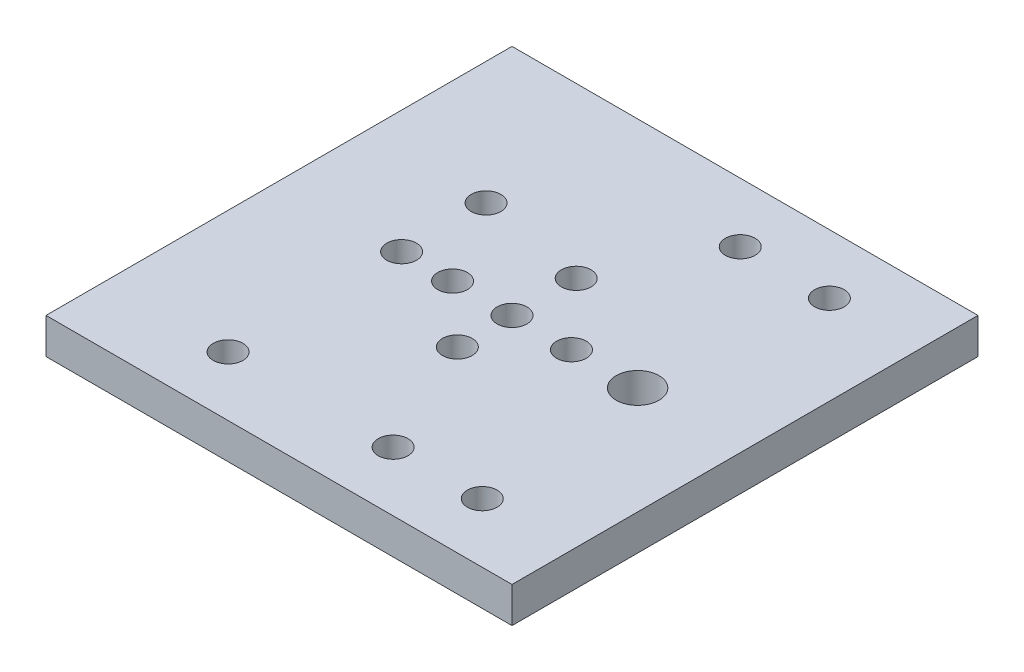
ISO-10303-21;
HEADER;
FILE_DESCRIPTION(('STEP AP214'),'2;1');
FILE_NAME('part.step','',(''),(''),'','','');
FILE_SCHEMA(('AUTOMOTIVE_DESIGN { 1 0 10303 214 1 1 1 1 }'));
ENDSEC;
DATA;
#1=APPLICATION_CONTEXT('core data for automotive mechanical design processes');
#2=APPLICATION_PROTOCOL_DEFINITION('international standard','automotive_design',2000,#1);
#3=PRODUCT_CONTEXT('',#1,'mechanical');
#4=PRODUCT('Part','Part','',(#3));
#5=PRODUCT_RELATED_PRODUCT_CATEGORY('part','',(#4));
#6=PRODUCT_DEFINITION_FORMATION('','',#4);
#7=PRODUCT_DEFINITION_CONTEXT('part definition',#1,'design');
#8=PRODUCT_DEFINITION('design','',#6,#7);
#9=PRODUCT_DEFINITION_SHAPE('','',#8);
#10=(LENGTH_UNIT() NAMED_UNIT(*) SI_UNIT(.MILLI.,.METRE.));
#11=(NAMED_UNIT(*) PLANE_ANGLE_UNIT() SI_UNIT($,.RADIAN.));
#12=(NAMED_UNIT(*) SI_UNIT($,.STERADIAN.) SOLID_ANGLE_UNIT());
#13=UNCERTAINTY_MEASURE_WITH_UNIT(LENGTH_MEASURE(1.E-05),#10,'distance_accuracy_value','');
#14=(GEOMETRIC_REPRESENTATION_CONTEXT(3) GLOBAL_UNCERTAINTY_ASSIGNED_CONTEXT((#13)) GLOBAL_UNIT_ASSIGNED_CONTEXT((#10,
#11,#12)) REPRESENTATION_CONTEXT('',''));
#15=CARTESIAN_POINT('',(0.,0.,0.));
#16=DIRECTION('',(0.,0.,1.));
#17=DIRECTION('',(1.,0.,0.));
#18=AXIS2_PLACEMENT_3D('',#15,#16,#17);
#19=CARTESIAN_POINT('',(0.,6.,0.));
#20=DIRECTION('',(0.,1.,0.));
#21=DIRECTION('',(0.,0.,1.));
#22=AXIS2_PLACEMENT_3D('',#19,#20,#21);
#23=PLANE('',#22);
#24=CARTESIAN_POINT('',(64.574651673796,6.,38.9945207187271));
#25=DIRECTION('',(0.,1.,0.));
#26=DIRECTION('',(0.,0.,1.));
#27=AXIS2_PLACEMENT_3D('',#24,#25,#26);
#28=CIRCLE('',#27,2.5);
#29=CARTESIAN_POINT('',(64.574651673796,6.,41.4945207187271));
#30=VERTEX_POINT('',#29);
#31=EDGE_CURVE('E174',#30,#30,#28,.T.);
#32=ORIENTED_EDGE('',*,*,#31,.F.);
#33=EDGE_LOOP('',(#32));
#34=FACE_BOUND('',#33,.T.);
#35=CARTESIAN_POINT('',(40.375415282392,6.,18.9945207187271));
#36=DIRECTION('',(0.,1.,0.));
#37=DIRECTION('',(0.,0.,1.));
#38=AXIS2_PLACEMENT_3D('',#35,#36,#37);
#39=CIRCLE('',#38,2.5);
#40=CARTESIAN_POINT('',(40.375415282392,6.,21.4945207187271));
#41=VERTEX_POINT('',#40);
#42=EDGE_CURVE('E162',#41,#41,#39,.T.);
#43=ORIENTED_EDGE('',*,*,#42,.F.);
#44=EDGE_LOOP('',(#43));
#45=FACE_BOUND('',#44,.T.);
#46=CARTESIAN_POINT('',(64.574651673796,6.,-19.4039520640808));
#47=DIRECTION('',(0.,1.,0.));
#48=DIRECTION('',(0.,0.,1.));
#49=AXIS2_PLACEMENT_3D('',#46,#47,#48);
#50=CIRCLE('',#49,2.49999999999999);
#51=CARTESIAN_POINT('',(64.574651673796,6.,-16.9039520640808));
#52=VERTEX_POINT('',#51);
#53=EDGE_CURVE('E150',#52,#52,#50,.T.);
#54=ORIENTED_EDGE('',*,*,#53,.F.);
#55=EDGE_LOOP('',(#54));
#56=FACE_BOUND('',#55,.T.);
#57=CARTESIAN_POINT('',(21.8066370561457,6.,9.79528432732314));
#58=DIRECTION('',(0.,1.,0.));
#59=DIRECTION('',(0.,0.,1.));
#60=AXIS2_PLACEMENT_3D('',#57,#58,#59);
#61=CIRCLE('',#60,2.5);
#62=CARTESIAN_POINT('',(21.8066370561457,6.,12.2952843273231));
#63=VERTEX_POINT('',#62);
#64=EDGE_CURVE('E138',#63,#63,#61,.T.);
#65=ORIENTED_EDGE('',*,*,#64,.F.);
#66=EDGE_LOOP('',(#65));
#67=FACE_BOUND('',#66,.T.);
#68=CARTESIAN_POINT('',(40.375415282392,6.,9.79528432732314));
#69=DIRECTION('',(0.,1.,0.));
#70=DIRECTION('',(0.,0.,1.));
#71=AXIS2_PLACEMENT_3D('',#68,#69,#70);
#72=CIRCLE('',#71,2.5);
#73=CARTESIAN_POINT('',(40.375415282392,6.,12.2952843273231));
#74=VERTEX_POINT('',#73);
#75=EDGE_CURVE('E126',#74,#74,#72,.T.);
#76=ORIENTED_EDGE('',*,*,#75,.F.);
#77=EDGE_LOOP('',(#76));
#78=FACE_BOUND('',#77,.T.);
#79=CARTESIAN_POINT('',(21.8066370561457,6.,38.9945207187271));
#80=DIRECTION('',(0.,1.,0.));
#81=DIRECTION('',(0.,0.,1.));
#82=AXIS2_PLACEMENT_3D('',#79,#80,#81);
#83=CIRCLE('',#82,2.5);
#84=CARTESIAN_POINT('',(21.8066370561457,6.,41.4945207187271));
#85=VERTEX_POINT('',#84);
#86=EDGE_CURVE('E114',#85,#85,#83,.T.);
#87=ORIENTED_EDGE('',*,*,#86,.F.);
#88=EDGE_LOOP('',(#87));
#89=FACE_BOUND('',#88,.T.);
#90=DIRECTION('',(1.,0.,0.));
#91=VECTOR('',#90,1.);
#92=CARTESIAN_POINT('',(1.17617889098803,6.,48.9945207187271));
#93=LINE('',#92,#91);
#94=CARTESIAN_POINT('',(1.17617889098803,6.,48.9945207187271));
#95=VERTEX_POINT('',#94);
#96=CARTESIAN_POINT('',(79.574651673796,6.,48.9945207187271));
#97=VERTEX_POINT('',#96);
#98=EDGE_CURVE('E84',#95,#97,#93,.T.);
#99=ORIENTED_EDGE('',*,*,#98,.T.);
#100=DIRECTION('',(0.,0.,-1.));
#101=VECTOR('',#100,1.);
#102=CARTESIAN_POINT('',(79.574651673796,6.,48.9945207187271));
#103=LINE('',#102,#101);
#104=CARTESIAN_POINT('',(79.574651673796,6.,-29.4039520640808));
#105=VERTEX_POINT('',#104);
#106=EDGE_CURVE('E79',#97,#105,#103,.T.);
#107=ORIENTED_EDGE('',*,*,#106,.T.);
#108=DIRECTION('',(-1.,0.,0.));
#109=VECTOR('',#108,1.);
#110=CARTESIAN_POINT('',(1.17617889098802,6.,-29.4039520640808));
#111=LINE('',#110,#109);
#112=CARTESIAN_POINT('',(1.17617889098802,6.,-29.4039520640808));
#113=VERTEX_POINT('',#112);
#114=EDGE_CURVE('E82',#105,#113,#111,.T.);
#115=ORIENTED_EDGE('',*,*,#114,.T.);
#116=DIRECTION('',(0.,0.,1.));
#117=VECTOR('',#116,1.);
#118=CARTESIAN_POINT('',(1.17617889098802,6.,-29.4039520640808));
#119=LINE('',#118,#117);
#120=EDGE_CURVE('E49',#113,#95,#119,.T.);
#121=ORIENTED_EDGE('',*,*,#120,.T.);
#122=EDGE_LOOP('',(#99,#107,#115,#121));
#123=FACE_BOUND('',#122,.T.);
#124=CARTESIAN_POINT('',(21.8066370561457,6.,-4.40395206408081));
#125=DIRECTION('',(0.,1.,0.));
#126=DIRECTION('',(0.,0.,1.));
#127=AXIS2_PLACEMENT_3D('',#124,#125,#126);
#128=CIRCLE('',#127,2.5);
#129=CARTESIAN_POINT('',(21.8066370561457,6.,-1.90395206408081));
#130=VERTEX_POINT('',#129);
#131=EDGE_CURVE('E99',#130,#130,#128,.T.);
#132=ORIENTED_EDGE('',*,*,#131,.F.);
#133=EDGE_LOOP('',(#132));
#134=FACE_BOUND('',#133,.T.);
#135=CARTESIAN_POINT('',(61.5066370561457,6.,9.79528432732314));
#136=DIRECTION('',(0.,1.,0.));
#137=DIRECTION('',(0.,0.,1.));
#138=AXIS2_PLACEMENT_3D('',#135,#136,#137);
#139=CIRCLE('',#138,3.59999999999999);
#140=CARTESIAN_POINT('',(61.5066370561457,6.,13.3952843273231));
#141=VERTEX_POINT('',#140);
#142=EDGE_CURVE('E120',#141,#141,#139,.T.);
#143=ORIENTED_EDGE('',*,*,#142,.F.);
#144=EDGE_LOOP('',(#143));
#145=FACE_BOUND('',#144,.T.);
#146=CARTESIAN_POINT('',(30.375415282392,6.,9.79528432732314));
#147=DIRECTION('',(0.,1.,0.));
#148=DIRECTION('',(0.,0.,1.));
#149=AXIS2_PLACEMENT_3D('',#146,#147,#148);
#150=CIRCLE('',#149,2.5);
#151=CARTESIAN_POINT('',(30.375415282392,6.,12.2952843273231));
#152=VERTEX_POINT('',#151);
#153=EDGE_CURVE('E132',#152,#152,#150,.T.);
#154=ORIENTED_EDGE('',*,*,#153,.F.);
#155=EDGE_LOOP('',(#154));
#156=FACE_BOUND('',#155,.T.);
#157=CARTESIAN_POINT('',(50.375415282392,6.,9.79528432732314));
#158=DIRECTION('',(0.,1.,0.));
#159=DIRECTION('',(0.,0.,1.));
#160=AXIS2_PLACEMENT_3D('',#157,#158,#159);
#161=CIRCLE('',#160,2.5);
#162=CARTESIAN_POINT('',(50.375415282392,6.,12.2952843273231));
#163=VERTEX_POINT('',#162);
#164=EDGE_CURVE('E144',#163,#163,#161,.T.);
#165=ORIENTED_EDGE('',*,*,#164,.F.);
#166=EDGE_LOOP('',(#165));
#167=FACE_BOUND('',#166,.T.);
#168=CARTESIAN_POINT('',(49.574651673796,6.,-19.4039520640808));
#169=DIRECTION('',(0.,1.,0.));
#170=DIRECTION('',(0.,0.,1.));
#171=AXIS2_PLACEMENT_3D('',#168,#169,#170);
#172=CIRCLE('',#171,2.5);
#173=CARTESIAN_POINT('',(49.574651673796,6.,-16.9039520640808));
#174=VERTEX_POINT('',#173);
#175=EDGE_CURVE('E156',#174,#174,#172,.T.);
#176=ORIENTED_EDGE('',*,*,#175,.F.);
#177=EDGE_LOOP('',(#176));
#178=FACE_BOUND('',#177,.T.);
#179=CARTESIAN_POINT('',(40.375415282392,6.,-1.00547928127294));
#180=DIRECTION('',(0.,1.,0.));
#181=DIRECTION('',(0.,0.,1.));
#182=AXIS2_PLACEMENT_3D('',#179,#180,#181);
#183=CIRCLE('',#182,2.5);
#184=CARTESIAN_POINT('',(40.375415282392,6.,1.49452071872706));
#185=VERTEX_POINT('',#184);
#186=EDGE_CURVE('E168',#185,#185,#183,.T.);
#187=ORIENTED_EDGE('',*,*,#186,.F.);
#188=EDGE_LOOP('',(#187));
#189=FACE_BOUND('',#188,.T.);
#190=CARTESIAN_POINT('',(49.574651673796,6.,38.9945207187271));
#191=DIRECTION('',(0.,1.,0.));
#192=DIRECTION('',(0.,0.,1.));
#193=AXIS2_PLACEMENT_3D('',#190,#191,#192);
#194=CIRCLE('',#193,2.5);
#195=CARTESIAN_POINT('',(49.574651673796,6.,41.4945207187271));
#196=VERTEX_POINT('',#195);
#197=EDGE_CURVE('E180',#196,#196,#194,.T.);
#198=ORIENTED_EDGE('',*,*,#197,.F.);
#199=EDGE_LOOP('',(#198));
#200=FACE_BOUND('',#199,.T.);
#201=ADVANCED_FACE('F32',(#34,#45,#56,#67,#78,#89,#123,#134,#145,#156,#167,#178,#189,#200),#23,.T.);
#202=CARTESIAN_POINT('',(0.,0.,0.));
#203=DIRECTION('',(0.,1.,0.));
#204=DIRECTION('',(0.,0.,1.));
#205=AXIS2_PLACEMENT_3D('',#202,#203,#204);
#206=PLANE('',#205);
#207=DIRECTION('',(1.,0.,0.));
#208=VECTOR('',#207,1.);
#209=CARTESIAN_POINT('',(1.17617889098803,0.,48.9945207187271));
#210=LINE('',#209,#208);
#211=CARTESIAN_POINT('',(1.17617889098803,0.,48.9945207187271));
#212=VERTEX_POINT('',#211);
#213=CARTESIAN_POINT('',(79.574651673796,0.,48.9945207187271));
#214=VERTEX_POINT('',#213);
#215=EDGE_CURVE('E96',#212,#214,#210,.T.);
#216=ORIENTED_EDGE('',*,*,#215,.F.);
#217=DIRECTION('',(0.,0.,1.));
#218=VECTOR('',#217,1.);
#219=CARTESIAN_POINT('',(1.17617889098802,0.,-29.4039520640808));
#220=LINE('',#219,#218);
#221=CARTESIAN_POINT('',(1.17617889098802,0.,-29.4039520640808));
#222=VERTEX_POINT('',#221);
#223=EDGE_CURVE('E72',#222,#212,#220,.T.);
#224=ORIENTED_EDGE('',*,*,#223,.F.);
#225=DIRECTION('',(-1.,0.,0.));
#226=VECTOR('',#225,1.);
#227=CARTESIAN_POINT('',(1.17617889098802,0.,-29.4039520640808));
#228=LINE('',#227,#226);
#229=CARTESIAN_POINT('',(79.574651673796,0.,-29.4039520640808));
#230=VERTEX_POINT('',#229);
#231=EDGE_CURVE('E66',#230,#222,#228,.T.);
#232=ORIENTED_EDGE('',*,*,#231,.F.);
#233=DIRECTION('',(0.,0.,-1.));
#234=VECTOR('',#233,1.);
#235=CARTESIAN_POINT('',(79.574651673796,0.,48.9945207187271));
#236=LINE('',#235,#234);
#237=EDGE_CURVE('E88',#214,#230,#236,.T.);
#238=ORIENTED_EDGE('',*,*,#237,.F.);
#239=EDGE_LOOP('',(#216,#224,#232,#238));
#240=FACE_BOUND('',#239,.T.);
#241=CARTESIAN_POINT('',(21.8066370561457,0.,-4.40395206408081));
#242=DIRECTION('',(0.,1.,0.));
#243=DIRECTION('',(0.,0.,1.));
#244=AXIS2_PLACEMENT_3D('',#241,#242,#243);
#245=CIRCLE('',#244,2.5);
#246=CARTESIAN_POINT('',(21.8066370561457,0.,-1.90395206408081));
#247=VERTEX_POINT('',#246);
#248=EDGE_CURVE('E111',#247,#247,#245,.T.);
#249=ORIENTED_EDGE('',*,*,#248,.T.);
#250=EDGE_LOOP('',(#249));
#251=FACE_BOUND('',#250,.T.);
#252=CARTESIAN_POINT('',(21.8066370561457,0.,38.9945207187271));
#253=DIRECTION('',(0.,1.,0.));
#254=DIRECTION('',(0.,0.,1.));
#255=AXIS2_PLACEMENT_3D('',#252,#253,#254);
#256=CIRCLE('',#255,2.5);
#257=CARTESIAN_POINT('',(21.8066370561457,0.,41.4945207187271));
#258=VERTEX_POINT('',#257);
#259=EDGE_CURVE('E117',#258,#258,#256,.T.);
#260=ORIENTED_EDGE('',*,*,#259,.T.);
#261=EDGE_LOOP('',(#260));
#262=FACE_BOUND('',#261,.T.);
#263=CARTESIAN_POINT('',(61.5066370561457,0.,9.79528432732314));
#264=DIRECTION('',(0.,1.,0.));
#265=DIRECTION('',(0.,0.,1.));
#266=AXIS2_PLACEMENT_3D('',#263,#264,#265);
#267=CIRCLE('',#266,3.59999999999999);
#268=CARTESIAN_POINT('',(61.5066370561457,0.,13.3952843273231));
#269=VERTEX_POINT('',#268);
#270=EDGE_CURVE('E123',#269,#269,#267,.T.);
#271=ORIENTED_EDGE('',*,*,#270,.T.);
#272=EDGE_LOOP('',(#271));
#273=FACE_BOUND('',#272,.T.);
#274=CARTESIAN_POINT('',(40.375415282392,0.,9.79528432732314));
#275=DIRECTION('',(0.,1.,0.));
#276=DIRECTION('',(0.,0.,1.));
#277=AXIS2_PLACEMENT_3D('',#274,#275,#276);
#278=CIRCLE('',#277,2.5);
#279=CARTESIAN_POINT('',(40.375415282392,0.,12.2952843273231));
#280=VERTEX_POINT('',#279);
#281=EDGE_CURVE('E129',#280,#280,#278,.T.);
#282=ORIENTED_EDGE('',*,*,#281,.T.);
#283=EDGE_LOOP('',(#282));
#284=FACE_BOUND('',#283,.T.);
#285=CARTESIAN_POINT('',(30.375415282392,0.,9.79528432732314));
#286=DIRECTION('',(0.,1.,0.));
#287=DIRECTION('',(0.,0.,1.));
#288=AXIS2_PLACEMENT_3D('',#285,#286,#287);
#289=CIRCLE('',#288,2.5);
#290=CARTESIAN_POINT('',(30.375415282392,0.,12.2952843273231));
#291=VERTEX_POINT('',#290);
#292=EDGE_CURVE('E135',#291,#291,#289,.T.);
#293=ORIENTED_EDGE('',*,*,#292,.T.);
#294=EDGE_LOOP('',(#293));
#295=FACE_BOUND('',#294,.T.);
#296=CARTESIAN_POINT('',(21.8066370561457,0.,9.79528432732314));
#297=DIRECTION('',(0.,1.,0.));
#298=DIRECTION('',(0.,0.,1.));
#299=AXIS2_PLACEMENT_3D('',#296,#297,#298);
#300=CIRCLE('',#299,2.5);
#301=CARTESIAN_POINT('',(21.8066370561457,0.,12.2952843273231));
#302=VERTEX_POINT('',#301);
#303=EDGE_CURVE('E141',#302,#302,#300,.T.);
#304=ORIENTED_EDGE('',*,*,#303,.T.);
#305=EDGE_LOOP('',(#304));
#306=FACE_BOUND('',#305,.T.);
#307=CARTESIAN_POINT('',(50.375415282392,0.,9.79528432732314));
#308=DIRECTION('',(0.,1.,0.));
#309=DIRECTION('',(0.,0.,1.));
#310=AXIS2_PLACEMENT_3D('',#307,#308,#309);
#311=CIRCLE('',#310,2.5);
#312=CARTESIAN_POINT('',(50.375415282392,0.,12.2952843273231));
#313=VERTEX_POINT('',#312);
#314=EDGE_CURVE('E147',#313,#313,#311,.T.);
#315=ORIENTED_EDGE('',*,*,#314,.T.);
#316=EDGE_LOOP('',(#315));
#317=FACE_BOUND('',#316,.T.);
#318=CARTESIAN_POINT('',(64.574651673796,0.,-19.4039520640808));
#319=DIRECTION('',(0.,1.,0.));
#320=DIRECTION('',(0.,0.,1.));
#321=AXIS2_PLACEMENT_3D('',#318,#319,#320);
#322=CIRCLE('',#321,2.49999999999999);
#323=CARTESIAN_POINT('',(64.574651673796,0.,-16.9039520640808));
#324=VERTEX_POINT('',#323);
#325=EDGE_CURVE('E153',#324,#324,#322,.T.);
#326=ORIENTED_EDGE('',*,*,#325,.T.);
#327=EDGE_LOOP('',(#326));
#328=FACE_BOUND('',#327,.T.);
#329=CARTESIAN_POINT('',(49.574651673796,0.,-19.4039520640808));
#330=DIRECTION('',(0.,1.,0.));
#331=DIRECTION('',(0.,0.,1.));
#332=AXIS2_PLACEMENT_3D('',#329,#330,#331);
#333=CIRCLE('',#332,2.5);
#334=CARTESIAN_POINT('',(49.574651673796,0.,-16.9039520640808));
#335=VERTEX_POINT('',#334);
#336=EDGE_CURVE('E159',#335,#335,#333,.T.);
#337=ORIENTED_EDGE('',*,*,#336,.T.);
#338=EDGE_LOOP('',(#337));
#339=FACE_BOUND('',#338,.T.);
#340=CARTESIAN_POINT('',(40.375415282392,0.,18.9945207187271));
#341=DIRECTION('',(0.,1.,0.));
#342=DIRECTION('',(0.,0.,1.));
#343=AXIS2_PLACEMENT_3D('',#340,#341,#342);
#344=CIRCLE('',#343,2.5);
#345=CARTESIAN_POINT('',(40.375415282392,0.,21.4945207187271));
#346=VERTEX_POINT('',#345);
#347=EDGE_CURVE('E165',#346,#346,#344,.T.);
#348=ORIENTED_EDGE('',*,*,#347,.T.);
#349=EDGE_LOOP('',(#348));
#350=FACE_BOUND('',#349,.T.);
#351=CARTESIAN_POINT('',(40.375415282392,0.,-1.00547928127294));
#352=DIRECTION('',(0.,1.,0.));
#353=DIRECTION('',(0.,0.,1.));
#354=AXIS2_PLACEMENT_3D('',#351,#352,#353);
#355=CIRCLE('',#354,2.5);
#356=CARTESIAN_POINT('',(40.375415282392,0.,1.49452071872706));
#357=VERTEX_POINT('',#356);
#358=EDGE_CURVE('E171',#357,#357,#355,.T.);
#359=ORIENTED_EDGE('',*,*,#358,.T.);
#360=EDGE_LOOP('',(#359));
#361=FACE_BOUND('',#360,.T.);
#362=CARTESIAN_POINT('',(64.574651673796,0.,38.9945207187271));
#363=DIRECTION('',(0.,1.,0.));
#364=DIRECTION('',(0.,0.,1.));
#365=AXIS2_PLACEMENT_3D('',#362,#363,#364);
#366=CIRCLE('',#365,2.5);
#367=CARTESIAN_POINT('',(64.574651673796,0.,41.4945207187271));
#368=VERTEX_POINT('',#367);
#369=EDGE_CURVE('E177',#368,#368,#366,.T.);
#370=ORIENTED_EDGE('',*,*,#369,.T.);
#371=EDGE_LOOP('',(#370));
#372=FACE_BOUND('',#371,.T.);
#373=CARTESIAN_POINT('',(49.574651673796,0.,38.9945207187271));
#374=DIRECTION('',(0.,1.,0.));
#375=DIRECTION('',(0.,0.,1.));
#376=AXIS2_PLACEMENT_3D('',#373,#374,#375);
#377=CIRCLE('',#376,2.5);
#378=CARTESIAN_POINT('',(49.574651673796,0.,41.4945207187271));
#379=VERTEX_POINT('',#378);
#380=EDGE_CURVE('E183',#379,#379,#377,.T.);
#381=ORIENTED_EDGE('',*,*,#380,.T.);
#382=EDGE_LOOP('',(#381));
#383=FACE_BOUND('',#382,.T.);
#384=ADVANCED_FACE('F107',(#240,#251,#262,#273,#284,#295,#306,#317,#328,#339,#350,#361,#372,
#383),#206,.F.);
#385=CARTESIAN_POINT('',(1.17617889098803,6.,48.9945207187271));
#386=DIRECTION('',(0.,0.,-1.));
#387=DIRECTION('',(-1.,0.,0.));
#388=AXIS2_PLACEMENT_3D('',#385,#386,#387);
#389=PLANE('',#388);
#390=ORIENTED_EDGE('',*,*,#215,.T.);
#391=DIRECTION('',(0.,-1.,0.));
#392=VECTOR('',#391,1.);
#393=CARTESIAN_POINT('',(79.574651673796,6.,48.9945207187271));
#394=LINE('',#393,#392);
#395=EDGE_CURVE('E11',#97,#214,#394,.T.);
#396=ORIENTED_EDGE('',*,*,#395,.F.);
#397=ORIENTED_EDGE('',*,*,#98,.F.);
#398=DIRECTION('',(0.,-1.,0.));
#399=VECTOR('',#398,1.);
#400=CARTESIAN_POINT('',(1.17617889098803,6.,48.9945207187271));
#401=LINE('',#400,#399);
#402=EDGE_CURVE('E92',#95,#212,#401,.T.);
#403=ORIENTED_EDGE('',*,*,#402,.T.);
#404=EDGE_LOOP('',(#390,#396,#397,#403));
#405=FACE_BOUND('',#404,.T.);
#406=ADVANCED_FACE('F34',(#405),#389,.F.);
#407=CARTESIAN_POINT('',(79.574651673796,6.,48.9945207187271));
#408=DIRECTION('',(-1.,0.,0.));
#409=DIRECTION('',(0.,0.,1.));
#410=AXIS2_PLACEMENT_3D('',#407,#408,#409);
#411=PLANE('',#410);
#412=ORIENTED_EDGE('',*,*,#237,.T.);
#413=DIRECTION('',(0.,-1.,0.));
#414=VECTOR('',#413,1.);
#415=CARTESIAN_POINT('',(79.574651673796,6.,-29.4039520640808));
#416=LINE('',#415,#414);
#417=EDGE_CURVE('E41',#105,#230,#416,.T.);
#418=ORIENTED_EDGE('',*,*,#417,.F.);
#419=ORIENTED_EDGE('',*,*,#106,.F.);
#420=ORIENTED_EDGE('',*,*,#395,.T.);
#421=EDGE_LOOP('',(#412,#418,#419,#420));
#422=FACE_BOUND('',#421,.T.);
#423=ADVANCED_FACE('F87',(#422),#411,.F.);
#424=CARTESIAN_POINT('',(1.17617889098802,6.,-29.4039520640808));
#425=DIRECTION('',(0.,0.,1.));
#426=DIRECTION('',(1.,0.,0.));
#427=AXIS2_PLACEMENT_3D('',#424,#425,#426);
#428=PLANE('',#427);
#429=ORIENTED_EDGE('',*,*,#231,.T.);
#430=DIRECTION('',(0.,-1.,0.));
#431=VECTOR('',#430,1.);
#432=CARTESIAN_POINT('',(1.17617889098802,6.,-29.4039520640808));
#433=LINE('',#432,#431);
#434=EDGE_CURVE('E89',#113,#222,#433,.T.);
#435=ORIENTED_EDGE('',*,*,#434,.F.);
#436=ORIENTED_EDGE('',*,*,#114,.F.);
#437=ORIENTED_EDGE('',*,*,#417,.T.);
#438=EDGE_LOOP('',(#429,#435,#436,#437));
#439=FACE_BOUND('',#438,.T.);
#440=ADVANCED_FACE('F90',(#439),#428,.F.);
#441=CARTESIAN_POINT('',(1.17617889098802,6.,-29.4039520640808));
#442=DIRECTION('',(1.,0.,0.));
#443=DIRECTION('',(0.,0.,-1.));
#444=AXIS2_PLACEMENT_3D('',#441,#442,#443);
#445=PLANE('',#444);
#446=ORIENTED_EDGE('',*,*,#223,.T.);
#447=ORIENTED_EDGE('',*,*,#402,.F.);
#448=ORIENTED_EDGE('',*,*,#120,.F.);
#449=ORIENTED_EDGE('',*,*,#434,.T.);
#450=EDGE_LOOP('',(#446,#447,#448,#449));
#451=FACE_BOUND('',#450,.T.);
#452=ADVANCED_FACE('F104',(#451),#445,.F.);
#453=CARTESIAN_POINT('',(21.8066370561457,6.,-4.40395206408081));
#454=DIRECTION('',(0.,-1.,0.));
#455=DIRECTION('',(0.,0.,-1.));
#456=AXIS2_PLACEMENT_3D('',#453,#454,#455);
#457=CYLINDRICAL_SURFACE('',#456,2.5);
#458=ORIENTED_EDGE('',*,*,#131,.T.);
#459=EDGE_LOOP('',(#458));
#460=FACE_BOUND('',#459,.T.);
#461=ORIENTED_EDGE('',*,*,#248,.F.);
#462=EDGE_LOOP('',(#461));
#463=FACE_BOUND('',#462,.T.);
#464=ADVANCED_FACE('F202',(#460,#463),#457,.F.);
#465=CARTESIAN_POINT('',(21.8066370561457,6.,38.9945207187271));
#466=DIRECTION('',(0.,-1.,0.));
#467=DIRECTION('',(0.,0.,-1.));
#468=AXIS2_PLACEMENT_3D('',#465,#466,#467);
#469=CYLINDRICAL_SURFACE('',#468,2.5);
#470=ORIENTED_EDGE('',*,*,#86,.T.);
#471=EDGE_LOOP('',(#470));
#472=FACE_BOUND('',#471,.T.);
#473=ORIENTED_EDGE('',*,*,#259,.F.);
#474=EDGE_LOOP('',(#473));
#475=FACE_BOUND('',#474,.T.);
#476=ADVANCED_FACE('F248',(#472,#475),#469,.F.);
#477=CARTESIAN_POINT('',(61.5066370561457,6.,9.79528432732314));
#478=DIRECTION('',(0.,-1.,0.));
#479=DIRECTION('',(0.,0.,-1.));
#480=AXIS2_PLACEMENT_3D('',#477,#478,#479);
#481=CYLINDRICAL_SURFACE('',#480,3.59999999999999);
#482=ORIENTED_EDGE('',*,*,#142,.T.);
#483=EDGE_LOOP('',(#482));
#484=FACE_BOUND('',#483,.T.);
#485=ORIENTED_EDGE('',*,*,#270,.F.);
#486=EDGE_LOOP('',(#485));
#487=FACE_BOUND('',#486,.T.);
#488=ADVANCED_FACE('F256',(#484,#487),#481,.F.);
#489=CARTESIAN_POINT('',(40.375415282392,6.,9.79528432732314));
#490=DIRECTION('',(0.,-1.,0.));
#491=DIRECTION('',(0.,0.,-1.));
#492=AXIS2_PLACEMENT_3D('',#489,#490,#491);
#493=CYLINDRICAL_SURFACE('',#492,2.5);
#494=ORIENTED_EDGE('',*,*,#75,.T.);
#495=EDGE_LOOP('',(#494));
#496=FACE_BOUND('',#495,.T.);
#497=ORIENTED_EDGE('',*,*,#281,.F.);
#498=EDGE_LOOP('',(#497));
#499=FACE_BOUND('',#498,.T.);
#500=ADVANCED_FACE('F264',(#496,#499),#493,.F.);
#501=CARTESIAN_POINT('',(30.375415282392,6.,9.79528432732314));
#502=DIRECTION('',(0.,-1.,0.));
#503=DIRECTION('',(0.,0.,-1.));
#504=AXIS2_PLACEMENT_3D('',#501,#502,#503);
#505=CYLINDRICAL_SURFACE('',#504,2.5);
#506=ORIENTED_EDGE('',*,*,#153,.T.);
#507=EDGE_LOOP('',(#506));
#508=FACE_BOUND('',#507,.T.);
#509=ORIENTED_EDGE('',*,*,#292,.F.);
#510=EDGE_LOOP('',(#509));
#511=FACE_BOUND('',#510,.T.);
#512=ADVANCED_FACE('F273',(#508,#511),#505,.F.);
#513=CARTESIAN_POINT('',(21.8066370561457,6.,9.79528432732314));
#514=DIRECTION('',(0.,-1.,0.));
#515=DIRECTION('',(0.,0.,-1.));
#516=AXIS2_PLACEMENT_3D('',#513,#514,#515);
#517=CYLINDRICAL_SURFACE('',#516,2.5);
#518=ORIENTED_EDGE('',*,*,#64,.T.);
#519=EDGE_LOOP('',(#518));
#520=FACE_BOUND('',#519,.T.);
#521=ORIENTED_EDGE('',*,*,#303,.F.);
#522=EDGE_LOOP('',(#521));
#523=FACE_BOUND('',#522,.T.);
#524=ADVANCED_FACE('F282',(#520,#523),#517,.F.);
#525=CARTESIAN_POINT('',(50.375415282392,6.,9.79528432732314));
#526=DIRECTION('',(0.,-1.,0.));
#527=DIRECTION('',(0.,0.,-1.));
#528=AXIS2_PLACEMENT_3D('',#525,#526,#527);
#529=CYLINDRICAL_SURFACE('',#528,2.5);
#530=ORIENTED_EDGE('',*,*,#164,.T.);
#531=EDGE_LOOP('',(#530));
#532=FACE_BOUND('',#531,.T.);
#533=ORIENTED_EDGE('',*,*,#314,.F.);
#534=EDGE_LOOP('',(#533));
#535=FACE_BOUND('',#534,.T.);
#536=ADVANCED_FACE('F291',(#532,#535),#529,.F.);
#537=CARTESIAN_POINT('',(64.574651673796,6.,-19.4039520640808));
#538=DIRECTION('',(0.,-1.,0.));
#539=DIRECTION('',(0.,0.,-1.));
#540=AXIS2_PLACEMENT_3D('',#537,#538,#539);
#541=CYLINDRICAL_SURFACE('',#540,2.49999999999999);
#542=ORIENTED_EDGE('',*,*,#53,.T.);
#543=EDGE_LOOP('',(#542));
#544=FACE_BOUND('',#543,.T.);
#545=ORIENTED_EDGE('',*,*,#325,.F.);
#546=EDGE_LOOP('',(#545));
#547=FACE_BOUND('',#546,.T.);
#548=ADVANCED_FACE('F300',(#544,#547),#541,.F.);
#549=CARTESIAN_POINT('',(49.574651673796,6.,-19.4039520640808));
#550=DIRECTION('',(0.,-1.,0.));
#551=DIRECTION('',(0.,0.,-1.));
#552=AXIS2_PLACEMENT_3D('',#549,#550,#551);
#553=CYLINDRICAL_SURFACE('',#552,2.5);
#554=ORIENTED_EDGE('',*,*,#175,.T.);
#555=EDGE_LOOP('',(#554));
#556=FACE_BOUND('',#555,.T.);
#557=ORIENTED_EDGE('',*,*,#336,.F.);
#558=EDGE_LOOP('',(#557));
#559=FACE_BOUND('',#558,.T.);
#560=ADVANCED_FACE('F309',(#556,#559),#553,.F.);
#561=CARTESIAN_POINT('',(40.375415282392,6.,18.9945207187271));
#562=DIRECTION('',(0.,-1.,0.));
#563=DIRECTION('',(0.,0.,-1.));
#564=AXIS2_PLACEMENT_3D('',#561,#562,#563);
#565=CYLINDRICAL_SURFACE('',#564,2.5);
#566=ORIENTED_EDGE('',*,*,#42,.T.);
#567=EDGE_LOOP('',(#566));
#568=FACE_BOUND('',#567,.T.);
#569=ORIENTED_EDGE('',*,*,#347,.F.);
#570=EDGE_LOOP('',(#569));
#571=FACE_BOUND('',#570,.T.);
#572=ADVANCED_FACE('F318',(#568,#571),#565,.F.);
#573=CARTESIAN_POINT('',(40.375415282392,6.,-1.00547928127294));
#574=DIRECTION('',(0.,-1.,0.));
#575=DIRECTION('',(0.,0.,-1.));
#576=AXIS2_PLACEMENT_3D('',#573,#574,#575);
#577=CYLINDRICAL_SURFACE('',#576,2.5);
#578=ORIENTED_EDGE('',*,*,#186,.T.);
#579=EDGE_LOOP('',(#578));
#580=FACE_BOUND('',#579,.T.);
#581=ORIENTED_EDGE('',*,*,#358,.F.);
#582=EDGE_LOOP('',(#581));
#583=FACE_BOUND('',#582,.T.);
#584=ADVANCED_FACE('F327',(#580,#583),#577,.F.);
#585=CARTESIAN_POINT('',(64.574651673796,6.,38.9945207187271));
#586=DIRECTION('',(0.,-1.,0.));
#587=DIRECTION('',(0.,0.,-1.));
#588=AXIS2_PLACEMENT_3D('',#585,#586,#587);
#589=CYLINDRICAL_SURFACE('',#588,2.5);
#590=ORIENTED_EDGE('',*,*,#31,.T.);
#591=EDGE_LOOP('',(#590));
#592=FACE_BOUND('',#591,.T.);
#593=ORIENTED_EDGE('',*,*,#369,.F.);
#594=EDGE_LOOP('',(#593));
#595=FACE_BOUND('',#594,.T.);
#596=ADVANCED_FACE('F336',(#592,#595),#589,.F.);
#597=CARTESIAN_POINT('',(49.574651673796,6.,38.9945207187271));
#598=DIRECTION('',(0.,-1.,0.));
#599=DIRECTION('',(0.,0.,-1.));
#600=AXIS2_PLACEMENT_3D('',#597,#598,#599);
#601=CYLINDRICAL_SURFACE('',#600,2.5);
#602=ORIENTED_EDGE('',*,*,#197,.T.);
#603=EDGE_LOOP('',(#602));
#604=FACE_BOUND('',#603,.T.);
#605=ORIENTED_EDGE('',*,*,#380,.F.);
#606=EDGE_LOOP('',(#605));
#607=FACE_BOUND('',#606,.T.);
#608=ADVANCED_FACE('F189',(#604,#607),#601,.F.);
#609=CLOSED_SHELL('',(#201,#384,#406,#423,#440,#452,#464,#476,#488,#500,#512,#524,#536,#548,
#560,#572,#584,#596,#608));
#610=MANIFOLD_SOLID_BREP('B2',#609);
#611=ADVANCED_BREP_SHAPE_REPRESENTATION('',(#18,#610),#14);
#612=SHAPE_DEFINITION_REPRESENTATION(#9,#611);
ENDSEC;
END-ISO-10303-21;
